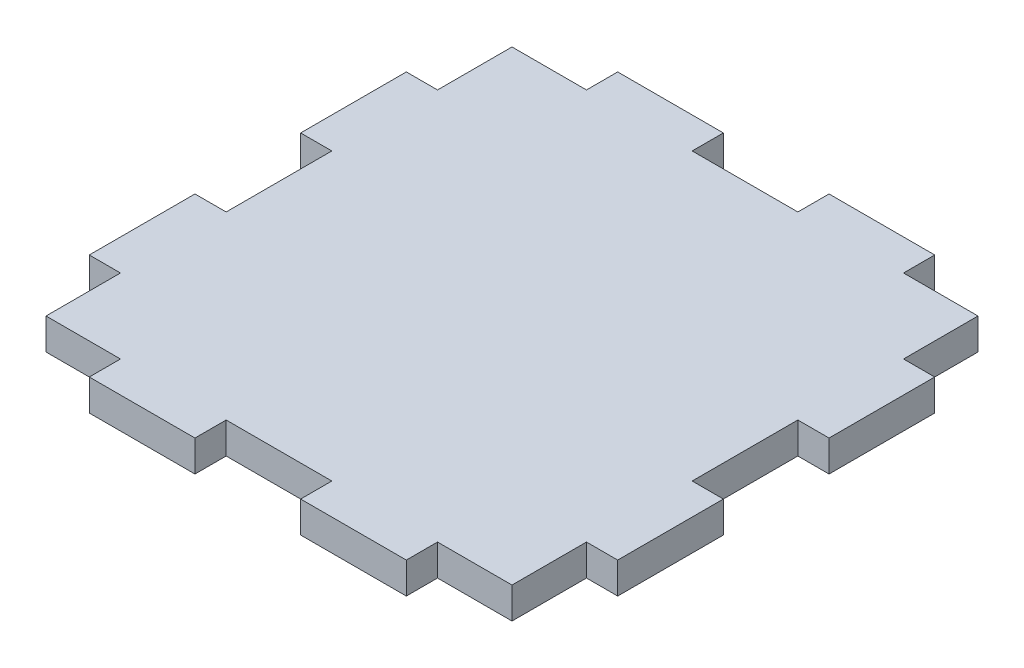
ISO-10303-21;
HEADER;
FILE_DESCRIPTION(('STEP AP214'),'2;1');
FILE_NAME('part.step','',(''),(''),'','','');
FILE_SCHEMA(('AUTOMOTIVE_DESIGN { 1 0 10303 214 1 1 1 1 }'));
ENDSEC;
DATA;
#1=APPLICATION_CONTEXT('core data for automotive mechanical design processes');
#2=APPLICATION_PROTOCOL_DEFINITION('international standard','automotive_design',2000,#1);
#3=PRODUCT_CONTEXT('',#1,'mechanical');
#4=PRODUCT('Part','Part','',(#3));
#5=PRODUCT_RELATED_PRODUCT_CATEGORY('part','',(#4));
#6=PRODUCT_DEFINITION_FORMATION('','',#4);
#7=PRODUCT_DEFINITION_CONTEXT('part definition',#1,'design');
#8=PRODUCT_DEFINITION('design','',#6,#7);
#9=PRODUCT_DEFINITION_SHAPE('','',#8);
#10=(LENGTH_UNIT() NAMED_UNIT(*) SI_UNIT(.MILLI.,.METRE.));
#11=(NAMED_UNIT(*) PLANE_ANGLE_UNIT() SI_UNIT($,.RADIAN.));
#12=(NAMED_UNIT(*) SI_UNIT($,.STERADIAN.) SOLID_ANGLE_UNIT());
#13=UNCERTAINTY_MEASURE_WITH_UNIT(LENGTH_MEASURE(1.E-05),#10,'distance_accuracy_value','');
#14=(GEOMETRIC_REPRESENTATION_CONTEXT(3) GLOBAL_UNCERTAINTY_ASSIGNED_CONTEXT((#13)) GLOBAL_UNIT_ASSIGNED_CONTEXT((#10,
#11,#12)) REPRESENTATION_CONTEXT('',''));
#15=CARTESIAN_POINT('',(0.,0.,0.));
#16=DIRECTION('',(0.,0.,1.));
#17=DIRECTION('',(1.,0.,0.));
#18=AXIS2_PLACEMENT_3D('',#15,#16,#17);
#19=CARTESIAN_POINT('',(0.,3.,0.));
#20=DIRECTION('',(1.,0.,0.));
#21=DIRECTION('',(0.,0.,-1.));
#22=AXIS2_PLACEMENT_3D('',#19,#20,#21);
#23=PLANE('',#22);
#24=DIRECTION('',(0.,1.,0.));
#25=VECTOR('',#24,1.);
#26=CARTESIAN_POINT('',(0.,0.,-30.48));
#27=LINE('',#26,#25);
#28=CARTESIAN_POINT('',(0.,0.,-30.48));
#29=VERTEX_POINT('',#28);
#30=CARTESIAN_POINT('',(0.,3.,-30.48));
#31=VERTEX_POINT('',#30);
#32=EDGE_CURVE('E274',#29,#31,#27,.T.);
#33=ORIENTED_EDGE('',*,*,#32,.T.);
#34=DIRECTION('',(0.,0.,1.));
#35=VECTOR('',#34,1.);
#36=CARTESIAN_POINT('',(0.,3.,0.));
#37=LINE('',#36,#35);
#38=CARTESIAN_POINT('',(0.,3.,-40.64));
#39=VERTEX_POINT('',#38);
#40=EDGE_CURVE('E516',#39,#31,#37,.T.);
#41=ORIENTED_EDGE('',*,*,#40,.F.);
#42=DIRECTION('',(0.,1.,0.));
#43=VECTOR('',#42,1.);
#44=CARTESIAN_POINT('',(0.,0.,-40.64));
#45=LINE('',#44,#43);
#46=CARTESIAN_POINT('',(0.,0.,-40.64));
#47=VERTEX_POINT('',#46);
#48=EDGE_CURVE('E508',#47,#39,#45,.T.);
#49=ORIENTED_EDGE('',*,*,#48,.F.);
#50=DIRECTION('',(0.,0.,1.));
#51=VECTOR('',#50,1.);
#52=CARTESIAN_POINT('',(0.,0.,0.));
#53=LINE('',#52,#51);
#54=EDGE_CURVE('E525',#47,#29,#53,.T.);
#55=ORIENTED_EDGE('',*,*,#54,.T.);
#56=EDGE_LOOP('',(#33,#41,#49,#55));
#57=FACE_BOUND('',#56,.T.);
#58=ADVANCED_FACE('F35',(#57),#23,.F.);
#59=CARTESIAN_POINT('',(0.,3.,0.));
#60=DIRECTION('',(0.,-1.,0.));
#61=DIRECTION('',(0.,0.,-1.));
#62=AXIS2_PLACEMENT_3D('',#59,#60,#61);
#63=PLANE('',#62);
#64=DIRECTION('',(0.,0.,1.));
#65=VECTOR('',#64,1.);
#66=CARTESIAN_POINT('',(2.99999999999988,3.,0.));
#67=LINE('',#66,#65);
#68=CARTESIAN_POINT('',(2.99999999999988,3.,-30.48));
#69=VERTEX_POINT('',#68);
#70=CARTESIAN_POINT('',(2.99999999999988,3.,-20.32));
#71=VERTEX_POINT('',#70);
#72=EDGE_CURVE('E286',#69,#71,#67,.T.);
#73=ORIENTED_EDGE('',*,*,#72,.T.);
#74=DIRECTION('',(1.,0.,0.));
#75=VECTOR('',#74,1.);
#76=CARTESIAN_POINT('',(0.,3.,-20.32));
#77=LINE('',#76,#75);
#78=CARTESIAN_POINT('',(0.,3.,-20.32));
#79=VERTEX_POINT('',#78);
#80=EDGE_CURVE('E291',#79,#71,#77,.T.);
#81=ORIENTED_EDGE('',*,*,#80,.F.);
#82=CARTESIAN_POINT('',(0.,3.,-10.16));
#83=VERTEX_POINT('',#82);
#84=EDGE_CURVE('E60',#79,#83,#37,.T.);
#85=ORIENTED_EDGE('',*,*,#84,.T.);
#86=DIRECTION('',(-1.,0.,0.));
#87=VECTOR('',#86,1.);
#88=CARTESIAN_POINT('',(0.,3.,-10.16));
#89=LINE('',#88,#87);
#90=CARTESIAN_POINT('',(2.99999999999992,3.,-10.16));
#91=VERTEX_POINT('',#90);
#92=EDGE_CURVE('E322',#91,#83,#89,.T.);
#93=ORIENTED_EDGE('',*,*,#92,.F.);
#94=DIRECTION('',(0.,0.,1.));
#95=VECTOR('',#94,1.);
#96=CARTESIAN_POINT('',(3.00000000000004,3.,0.));
#97=LINE('',#96,#95);
#98=CARTESIAN_POINT('',(3.,3.,-3.));
#99=VERTEX_POINT('',#98);
#100=EDGE_CURVE('E319',#91,#99,#97,.T.);
#101=ORIENTED_EDGE('',*,*,#100,.T.);
#102=DIRECTION('',(1.,0.,0.));
#103=VECTOR('',#102,1.);
#104=CARTESIAN_POINT('',(0.,3.,-3.));
#105=LINE('',#104,#103);
#106=CARTESIAN_POINT('',(10.16,3.,-3.));
#107=VERTEX_POINT('',#106);
#108=EDGE_CURVE('E301',#99,#107,#105,.T.);
#109=ORIENTED_EDGE('',*,*,#108,.T.);
#110=DIRECTION('',(0.,0.,-1.));
#111=VECTOR('',#110,1.);
#112=CARTESIAN_POINT('',(10.16,3.,0.));
#113=LINE('',#112,#111);
#114=CARTESIAN_POINT('',(10.16,3.,0.));
#115=VERTEX_POINT('',#114);
#116=EDGE_CURVE('E308',#115,#107,#113,.T.);
#117=ORIENTED_EDGE('',*,*,#116,.F.);
#118=DIRECTION('',(1.,0.,0.));
#119=VECTOR('',#118,1.);
#120=CARTESIAN_POINT('',(0.,3.,0.));
#121=LINE('',#120,#119);
#122=CARTESIAN_POINT('',(20.32,3.,0.));
#123=VERTEX_POINT('',#122);
#124=EDGE_CURVE('E520',#115,#123,#121,.T.);
#125=ORIENTED_EDGE('',*,*,#124,.T.);
#126=DIRECTION('',(0.,0.,-1.));
#127=VECTOR('',#126,1.);
#128=CARTESIAN_POINT('',(20.32,3.,0.));
#129=LINE('',#128,#127);
#130=CARTESIAN_POINT('',(20.32,3.,-3.));
#131=VERTEX_POINT('',#130);
#132=EDGE_CURVE('E328',#123,#131,#129,.T.);
#133=ORIENTED_EDGE('',*,*,#132,.T.);
#134=DIRECTION('',(1.,0.,0.));
#135=VECTOR('',#134,1.);
#136=CARTESIAN_POINT('',(0.,3.,-3.));
#137=LINE('',#136,#135);
#138=CARTESIAN_POINT('',(30.48,3.,-3.));
#139=VERTEX_POINT('',#138);
#140=EDGE_CURVE('E340',#131,#139,#137,.T.);
#141=ORIENTED_EDGE('',*,*,#140,.T.);
#142=DIRECTION('',(0.,0.,-1.));
#143=VECTOR('',#142,1.);
#144=CARTESIAN_POINT('',(30.48,3.,0.));
#145=LINE('',#144,#143);
#146=CARTESIAN_POINT('',(30.48,3.,0.));
#147=VERTEX_POINT('',#146);
#148=EDGE_CURVE('E348',#147,#139,#145,.T.);
#149=ORIENTED_EDGE('',*,*,#148,.F.);
#150=CARTESIAN_POINT('',(40.64,3.,0.));
#151=VERTEX_POINT('',#150);
#152=EDGE_CURVE('E519',#147,#151,#121,.T.);
#153=ORIENTED_EDGE('',*,*,#152,.T.);
#154=DIRECTION('',(0.,0.,-1.));
#155=VECTOR('',#154,1.);
#156=CARTESIAN_POINT('',(40.64,3.,0.));
#157=LINE('',#156,#155);
#158=CARTESIAN_POINT('',(40.64,3.,-3.));
#159=VERTEX_POINT('',#158);
#160=EDGE_CURVE('E366',#151,#159,#157,.T.);
#161=ORIENTED_EDGE('',*,*,#160,.T.);
#162=DIRECTION('',(1.,0.,0.));
#163=VECTOR('',#162,1.);
#164=CARTESIAN_POINT('',(0.,3.,-3.));
#165=LINE('',#164,#163);
#166=CARTESIAN_POINT('',(47.8000000000001,3.,-3.));
#167=VERTEX_POINT('',#166);
#168=EDGE_CURVE('E379',#159,#167,#165,.T.);
#169=ORIENTED_EDGE('',*,*,#168,.T.);
#170=DIRECTION('',(0.,0.,1.));
#171=VECTOR('',#170,1.);
#172=CARTESIAN_POINT('',(47.8000000000003,3.,-9.26478012868066E-13));
#173=LINE('',#172,#171);
#174=CARTESIAN_POINT('',(47.8000000000001,3.,-10.16));
#175=VERTEX_POINT('',#174);
#176=EDGE_CURVE('E376',#175,#167,#173,.T.);
#177=ORIENTED_EDGE('',*,*,#176,.F.);
#178=DIRECTION('',(1.,0.,0.));
#179=VECTOR('',#178,1.);
#180=CARTESIAN_POINT('',(0.,3.,-10.16));
#181=LINE('',#180,#179);
#182=CARTESIAN_POINT('',(50.8,3.,-10.16));
#183=VERTEX_POINT('',#182);
#184=EDGE_CURVE('E356',#175,#183,#181,.T.);
#185=ORIENTED_EDGE('',*,*,#184,.T.);
#186=DIRECTION('',(0.,0.,-1.));
#187=VECTOR('',#186,1.);
#188=CARTESIAN_POINT('',(50.8,3.,0.));
#189=LINE('',#188,#187);
#190=CARTESIAN_POINT('',(50.8,3.,-20.32));
#191=VERTEX_POINT('',#190);
#192=EDGE_CURVE('E523',#183,#191,#189,.T.);
#193=ORIENTED_EDGE('',*,*,#192,.T.);
#194=DIRECTION('',(-1.,0.,0.));
#195=VECTOR('',#194,1.);
#196=CARTESIAN_POINT('',(0.,3.,-20.32));
#197=LINE('',#196,#195);
#198=CARTESIAN_POINT('',(47.8000000000001,3.,-20.32));
#199=VERTEX_POINT('',#198);
#200=EDGE_CURVE('E399',#191,#199,#197,.T.);
#201=ORIENTED_EDGE('',*,*,#200,.T.);
#202=DIRECTION('',(0.,0.,1.));
#203=VECTOR('',#202,1.);
#204=CARTESIAN_POINT('',(47.8000000000001,3.,0.));
#205=LINE('',#204,#203);
#206=CARTESIAN_POINT('',(47.8000000000001,3.,-30.48));
#207=VERTEX_POINT('',#206);
#208=EDGE_CURVE('E408',#207,#199,#205,.T.);
#209=ORIENTED_EDGE('',*,*,#208,.F.);
#210=DIRECTION('',(-1.,0.,0.));
#211=VECTOR('',#210,1.);
#212=CARTESIAN_POINT('',(0.,3.,-30.4799999999999));
#213=LINE('',#212,#211);
#214=CARTESIAN_POINT('',(50.8,3.,-30.48));
#215=VERTEX_POINT('',#214);
#216=EDGE_CURVE('E386',#215,#207,#213,.T.);
#217=ORIENTED_EDGE('',*,*,#216,.F.);
#218=CARTESIAN_POINT('',(50.8,3.,-40.64));
#219=VERTEX_POINT('',#218);
#220=EDGE_CURVE('E522',#215,#219,#189,.T.);
#221=ORIENTED_EDGE('',*,*,#220,.T.);
#222=DIRECTION('',(-1.,0.,0.));
#223=VECTOR('',#222,1.);
#224=CARTESIAN_POINT('',(0.,3.,-40.64));
#225=LINE('',#224,#223);
#226=CARTESIAN_POINT('',(47.8000000000001,3.,-40.64));
#227=VERTEX_POINT('',#226);
#228=EDGE_CURVE('E426',#219,#227,#225,.T.);
#229=ORIENTED_EDGE('',*,*,#228,.T.);
#230=DIRECTION('',(0.,0.,1.));
#231=VECTOR('',#230,1.);
#232=CARTESIAN_POINT('',(47.7999999999993,3.,9.26478012868046E-13));
#233=LINE('',#232,#231);
#234=CARTESIAN_POINT('',(47.8000000000002,3.,-47.8));
#235=VERTEX_POINT('',#234);
#236=EDGE_CURVE('E440',#235,#227,#233,.T.);
#237=ORIENTED_EDGE('',*,*,#236,.F.);
#238=DIRECTION('',(1.,0.,0.));
#239=VECTOR('',#238,1.);
#240=CARTESIAN_POINT('',(0.,3.,-47.8));
#241=LINE('',#240,#239);
#242=CARTESIAN_POINT('',(40.64,3.,-47.8));
#243=VERTEX_POINT('',#242);
#244=EDGE_CURVE('E437',#243,#235,#241,.T.);
#245=ORIENTED_EDGE('',*,*,#244,.F.);
#246=DIRECTION('',(0.,0.,1.));
#247=VECTOR('',#246,1.);
#248=CARTESIAN_POINT('',(40.64,3.,0.));
#249=LINE('',#248,#247);
#250=CARTESIAN_POINT('',(40.64,3.,-50.8));
#251=VERTEX_POINT('',#250);
#252=EDGE_CURVE('E415',#251,#243,#249,.T.);
#253=ORIENTED_EDGE('',*,*,#252,.F.);
#254=DIRECTION('',(-1.,0.,0.));
#255=VECTOR('',#254,1.);
#256=CARTESIAN_POINT('',(0.,3.,-50.8));
#257=LINE('',#256,#255);
#258=CARTESIAN_POINT('',(30.48,3.,-50.8));
#259=VERTEX_POINT('',#258);
#260=EDGE_CURVE('E11',#251,#259,#257,.T.);
#261=ORIENTED_EDGE('',*,*,#260,.T.);
#262=DIRECTION('',(0.,0.,1.));
#263=VECTOR('',#262,1.);
#264=CARTESIAN_POINT('',(30.4800000000004,3.,-2.81996648254794E-13));
#265=LINE('',#264,#263);
#266=CARTESIAN_POINT('',(30.48,3.,-47.8));
#267=VERTEX_POINT('',#266);
#268=EDGE_CURVE('E447',#259,#267,#265,.T.);
#269=ORIENTED_EDGE('',*,*,#268,.T.);
#270=DIRECTION('',(1.,0.,0.));
#271=VECTOR('',#270,1.);
#272=CARTESIAN_POINT('',(0.,3.,-47.8));
#273=LINE('',#272,#271);
#274=CARTESIAN_POINT('',(20.32,3.,-47.8));
#275=VERTEX_POINT('',#274);
#276=EDGE_CURVE('E459',#275,#267,#273,.T.);
#277=ORIENTED_EDGE('',*,*,#276,.F.);
#278=DIRECTION('',(0.,0.,1.));
#279=VECTOR('',#278,1.);
#280=CARTESIAN_POINT('',(20.3199999999999,3.,0.));
#281=LINE('',#280,#279);
#282=CARTESIAN_POINT('',(20.32,3.,-50.8));
#283=VERTEX_POINT('',#282);
#284=EDGE_CURVE('E468',#283,#275,#281,.T.);
#285=ORIENTED_EDGE('',*,*,#284,.F.);
#286=CARTESIAN_POINT('',(10.16,3.,-50.8));
#287=VERTEX_POINT('',#286);
#288=EDGE_CURVE('E44',#283,#287,#257,.T.);
#289=ORIENTED_EDGE('',*,*,#288,.T.);
#290=DIRECTION('',(0.,0.,1.));
#291=VECTOR('',#290,1.);
#292=CARTESIAN_POINT('',(10.16,3.,0.));
#293=LINE('',#292,#291);
#294=CARTESIAN_POINT('',(10.16,3.,-47.8));
#295=VERTEX_POINT('',#294);
#296=EDGE_CURVE('E500',#287,#295,#293,.T.);
#297=ORIENTED_EDGE('',*,*,#296,.T.);
#298=DIRECTION('',(1.,0.,0.));
#299=VECTOR('',#298,1.);
#300=CARTESIAN_POINT('',(0.,3.,-47.8));
#301=LINE('',#300,#299);
#302=CARTESIAN_POINT('',(2.99999999999985,3.,-47.8));
#303=VERTEX_POINT('',#302);
#304=EDGE_CURVE('E497',#303,#295,#301,.T.);
#305=ORIENTED_EDGE('',*,*,#304,.F.);
#306=DIRECTION('',(0.,0.,1.));
#307=VECTOR('',#306,1.);
#308=CARTESIAN_POINT('',(3.00000000000071,3.,0.));
#309=LINE('',#308,#307);
#310=CARTESIAN_POINT('',(2.99999999999992,3.,-40.64));
#311=VERTEX_POINT('',#310);
#312=EDGE_CURVE('E475',#303,#311,#309,.T.);
#313=ORIENTED_EDGE('',*,*,#312,.T.);
#314=DIRECTION('',(1.,0.,0.));
#315=VECTOR('',#314,1.);
#316=CARTESIAN_POINT('',(0.,3.,-40.64));
#317=LINE('',#316,#315);
#318=EDGE_CURVE('E485',#39,#311,#317,.T.);
#319=ORIENTED_EDGE('',*,*,#318,.F.);
#320=ORIENTED_EDGE('',*,*,#40,.T.);
#321=DIRECTION('',(1.,0.,0.));
#322=VECTOR('',#321,1.);
#323=CARTESIAN_POINT('',(0.,3.,-30.48));
#324=LINE('',#323,#322);
#325=EDGE_CURVE('E52',#31,#69,#324,.T.);
#326=ORIENTED_EDGE('',*,*,#325,.T.);
#327=EDGE_LOOP('',(#73,#81,#85,#93,#101,#109,#117,#125,#133,#141,#149,#153,#161,#169,#177,#185,
#193,#201,#209,#217,#221,#229,#237,#245,#253,#261,#269,#277,#285,#289,#297,#305,#313,#319,#320,#326));
#328=FACE_BOUND('',#327,.T.);
#329=ADVANCED_FACE('F553',(#328),#63,.F.);
#330=CARTESIAN_POINT('',(0.,0.,0.));
#331=DIRECTION('',(0.,-1.,0.));
#332=DIRECTION('',(0.,0.,-1.));
#333=AXIS2_PLACEMENT_3D('',#330,#331,#332);
#334=PLANE('',#333);
#335=DIRECTION('',(1.,0.,0.));
#336=VECTOR('',#335,1.);
#337=CARTESIAN_POINT('',(0.,0.,-20.32));
#338=LINE('',#337,#336);
#339=CARTESIAN_POINT('',(0.,0.,-20.32));
#340=VERTEX_POINT('',#339);
#341=CARTESIAN_POINT('',(2.99999999999988,0.,-20.32));
#342=VERTEX_POINT('',#341);
#343=EDGE_CURVE('E279',#340,#342,#338,.T.);
#344=ORIENTED_EDGE('',*,*,#343,.T.);
#345=DIRECTION('',(0.,0.,1.));
#346=VECTOR('',#345,1.);
#347=CARTESIAN_POINT('',(2.99999999999988,0.,0.));
#348=LINE('',#347,#346);
#349=CARTESIAN_POINT('',(2.99999999999988,0.,-30.48));
#350=VERTEX_POINT('',#349);
#351=EDGE_CURVE('E280',#350,#342,#348,.T.);
#352=ORIENTED_EDGE('',*,*,#351,.F.);
#353=DIRECTION('',(1.,0.,0.));
#354=VECTOR('',#353,1.);
#355=CARTESIAN_POINT('',(0.,0.,-30.48));
#356=LINE('',#355,#354);
#357=EDGE_CURVE('E269',#29,#350,#356,.T.);
#358=ORIENTED_EDGE('',*,*,#357,.F.);
#359=ORIENTED_EDGE('',*,*,#54,.F.);
#360=DIRECTION('',(1.,0.,0.));
#361=VECTOR('',#360,1.);
#362=CARTESIAN_POINT('',(0.,0.,-40.64));
#363=LINE('',#362,#361);
#364=CARTESIAN_POINT('',(2.99999999999992,0.,-40.64));
#365=VERTEX_POINT('',#364);
#366=EDGE_CURVE('E491',#47,#365,#363,.T.);
#367=ORIENTED_EDGE('',*,*,#366,.T.);
#368=DIRECTION('',(0.,0.,1.));
#369=VECTOR('',#368,1.);
#370=CARTESIAN_POINT('',(3.00000000000071,0.,0.));
#371=LINE('',#370,#369);
#372=CARTESIAN_POINT('',(2.99999999999985,0.,-47.8));
#373=VERTEX_POINT('',#372);
#374=EDGE_CURVE('E482',#373,#365,#371,.T.);
#375=ORIENTED_EDGE('',*,*,#374,.F.);
#376=DIRECTION('',(1.,0.,0.));
#377=VECTOR('',#376,1.);
#378=CARTESIAN_POINT('',(0.,0.,-47.8));
#379=LINE('',#378,#377);
#380=CARTESIAN_POINT('',(10.16,0.,-47.8));
#381=VERTEX_POINT('',#380);
#382=EDGE_CURVE('E484',#373,#381,#379,.T.);
#383=ORIENTED_EDGE('',*,*,#382,.T.);
#384=DIRECTION('',(0.,0.,1.));
#385=VECTOR('',#384,1.);
#386=CARTESIAN_POINT('',(10.16,0.,0.));
#387=LINE('',#386,#385);
#388=CARTESIAN_POINT('',(10.16,0.,-50.8));
#389=VERTEX_POINT('',#388);
#390=EDGE_CURVE('E488',#389,#381,#387,.T.);
#391=ORIENTED_EDGE('',*,*,#390,.F.);
#392=DIRECTION('',(-1.,0.,0.));
#393=VECTOR('',#392,1.);
#394=CARTESIAN_POINT('',(0.,0.,-50.8));
#395=LINE('',#394,#393);
#396=CARTESIAN_POINT('',(20.32,0.,-50.8));
#397=VERTEX_POINT('',#396);
#398=EDGE_CURVE('E531',#397,#389,#395,.T.);
#399=ORIENTED_EDGE('',*,*,#398,.F.);
#400=DIRECTION('',(0.,0.,1.));
#401=VECTOR('',#400,1.);
#402=CARTESIAN_POINT('',(20.3199999999999,0.,0.));
#403=LINE('',#402,#401);
#404=CARTESIAN_POINT('',(20.32,0.,-47.8));
#405=VERTEX_POINT('',#404);
#406=EDGE_CURVE('E458',#397,#405,#403,.T.);
#407=ORIENTED_EDGE('',*,*,#406,.T.);
#408=DIRECTION('',(1.,0.,0.));
#409=VECTOR('',#408,1.);
#410=CARTESIAN_POINT('',(0.,0.,-47.8));
#411=LINE('',#410,#409);
#412=CARTESIAN_POINT('',(30.48,0.,-47.8));
#413=VERTEX_POINT('',#412);
#414=EDGE_CURVE('E462',#405,#413,#411,.T.);
#415=ORIENTED_EDGE('',*,*,#414,.T.);
#416=DIRECTION('',(0.,0.,1.));
#417=VECTOR('',#416,1.);
#418=CARTESIAN_POINT('',(30.4800000000004,0.,-2.81996648254794E-13));
#419=LINE('',#418,#417);
#420=CARTESIAN_POINT('',(30.48,0.,-50.8));
#421=VERTEX_POINT('',#420);
#422=EDGE_CURVE('E456',#421,#413,#419,.T.);
#423=ORIENTED_EDGE('',*,*,#422,.F.);
#424=CARTESIAN_POINT('',(40.64,0.,-50.8));
#425=VERTEX_POINT('',#424);
#426=EDGE_CURVE('E39',#425,#421,#395,.T.);
#427=ORIENTED_EDGE('',*,*,#426,.F.);
#428=DIRECTION('',(0.,0.,1.));
#429=VECTOR('',#428,1.);
#430=CARTESIAN_POINT('',(40.64,0.,0.));
#431=LINE('',#430,#429);
#432=CARTESIAN_POINT('',(40.64,0.,-47.8));
#433=VERTEX_POINT('',#432);
#434=EDGE_CURVE('E422',#425,#433,#431,.T.);
#435=ORIENTED_EDGE('',*,*,#434,.T.);
#436=DIRECTION('',(1.,0.,0.));
#437=VECTOR('',#436,1.);
#438=CARTESIAN_POINT('',(0.,0.,-47.8));
#439=LINE('',#438,#437);
#440=CARTESIAN_POINT('',(47.8000000000002,0.,-47.8));
#441=VERTEX_POINT('',#440);
#442=EDGE_CURVE('E425',#433,#441,#439,.T.);
#443=ORIENTED_EDGE('',*,*,#442,.T.);
#444=DIRECTION('',(0.,0.,1.));
#445=VECTOR('',#444,1.);
#446=CARTESIAN_POINT('',(47.7999999999993,0.,9.26478012868046E-13));
#447=LINE('',#446,#445);
#448=CARTESIAN_POINT('',(47.8000000000001,0.,-40.64));
#449=VERTEX_POINT('',#448);
#450=EDGE_CURVE('E429',#441,#449,#447,.T.);
#451=ORIENTED_EDGE('',*,*,#450,.T.);
#452=DIRECTION('',(-1.,0.,0.));
#453=VECTOR('',#452,1.);
#454=CARTESIAN_POINT('',(0.,0.,-40.64));
#455=LINE('',#454,#453);
#456=CARTESIAN_POINT('',(50.8,0.,-40.64));
#457=VERTEX_POINT('',#456);
#458=EDGE_CURVE('E432',#457,#449,#455,.T.);
#459=ORIENTED_EDGE('',*,*,#458,.F.);
#460=DIRECTION('',(0.,0.,-1.));
#461=VECTOR('',#460,1.);
#462=CARTESIAN_POINT('',(50.8,0.,0.));
#463=LINE('',#462,#461);
#464=CARTESIAN_POINT('',(50.8,0.,-30.48));
#465=VERTEX_POINT('',#464);
#466=EDGE_CURVE('E529',#465,#457,#463,.T.);
#467=ORIENTED_EDGE('',*,*,#466,.F.);
#468=DIRECTION('',(-1.,0.,0.));
#469=VECTOR('',#468,1.);
#470=CARTESIAN_POINT('',(0.,0.,-30.4799999999999));
#471=LINE('',#470,#469);
#472=CARTESIAN_POINT('',(47.8000000000001,0.,-30.48));
#473=VERTEX_POINT('',#472);
#474=EDGE_CURVE('E395',#465,#473,#471,.T.);
#475=ORIENTED_EDGE('',*,*,#474,.T.);
#476=DIRECTION('',(0.,0.,1.));
#477=VECTOR('',#476,1.);
#478=CARTESIAN_POINT('',(47.8000000000001,0.,0.));
#479=LINE('',#478,#477);
#480=CARTESIAN_POINT('',(47.8000000000001,0.,-20.32));
#481=VERTEX_POINT('',#480);
#482=EDGE_CURVE('E398',#473,#481,#479,.T.);
#483=ORIENTED_EDGE('',*,*,#482,.T.);
#484=DIRECTION('',(-1.,0.,0.));
#485=VECTOR('',#484,1.);
#486=CARTESIAN_POINT('',(0.,0.,-20.32));
#487=LINE('',#486,#485);
#488=CARTESIAN_POINT('',(50.8,0.,-20.32));
#489=VERTEX_POINT('',#488);
#490=EDGE_CURVE('E402',#489,#481,#487,.T.);
#491=ORIENTED_EDGE('',*,*,#490,.F.);
#492=CARTESIAN_POINT('',(50.8,0.,-10.16));
#493=VERTEX_POINT('',#492);
#494=EDGE_CURVE('E530',#493,#489,#463,.T.);
#495=ORIENTED_EDGE('',*,*,#494,.F.);
#496=DIRECTION('',(1.,0.,0.));
#497=VECTOR('',#496,1.);
#498=CARTESIAN_POINT('',(0.,0.,-10.16));
#499=LINE('',#498,#497);
#500=CARTESIAN_POINT('',(47.8000000000001,0.,-10.16));
#501=VERTEX_POINT('',#500);
#502=EDGE_CURVE('E363',#501,#493,#499,.T.);
#503=ORIENTED_EDGE('',*,*,#502,.F.);
#504=DIRECTION('',(0.,0.,1.));
#505=VECTOR('',#504,1.);
#506=CARTESIAN_POINT('',(47.8000000000003,0.,-9.26478012868066E-13));
#507=LINE('',#506,#505);
#508=CARTESIAN_POINT('',(47.8000000000001,0.,-3.));
#509=VERTEX_POINT('',#508);
#510=EDGE_CURVE('E365',#501,#509,#507,.T.);
#511=ORIENTED_EDGE('',*,*,#510,.T.);
#512=DIRECTION('',(1.,0.,0.));
#513=VECTOR('',#512,1.);
#514=CARTESIAN_POINT('',(0.,0.,-3.));
#515=LINE('',#514,#513);
#516=CARTESIAN_POINT('',(40.64,0.,-3.));
#517=VERTEX_POINT('',#516);
#518=EDGE_CURVE('E369',#517,#509,#515,.T.);
#519=ORIENTED_EDGE('',*,*,#518,.F.);
#520=DIRECTION('',(0.,0.,-1.));
#521=VECTOR('',#520,1.);
#522=CARTESIAN_POINT('',(40.64,0.,0.));
#523=LINE('',#522,#521);
#524=CARTESIAN_POINT('',(40.64,0.,0.));
#525=VERTEX_POINT('',#524);
#526=EDGE_CURVE('E371',#525,#517,#523,.T.);
#527=ORIENTED_EDGE('',*,*,#526,.F.);
#528=DIRECTION('',(1.,0.,0.));
#529=VECTOR('',#528,1.);
#530=CARTESIAN_POINT('',(0.,0.,0.));
#531=LINE('',#530,#529);
#532=CARTESIAN_POINT('',(30.48,0.,0.));
#533=VERTEX_POINT('',#532);
#534=EDGE_CURVE('E527',#533,#525,#531,.T.);
#535=ORIENTED_EDGE('',*,*,#534,.F.);
#536=DIRECTION('',(0.,0.,-1.));
#537=VECTOR('',#536,1.);
#538=CARTESIAN_POINT('',(30.48,0.,0.));
#539=LINE('',#538,#537);
#540=CARTESIAN_POINT('',(30.48,0.,-3.));
#541=VERTEX_POINT('',#540);
#542=EDGE_CURVE('E339',#533,#541,#539,.T.);
#543=ORIENTED_EDGE('',*,*,#542,.T.);
#544=DIRECTION('',(1.,0.,0.));
#545=VECTOR('',#544,1.);
#546=CARTESIAN_POINT('',(0.,0.,-3.));
#547=LINE('',#546,#545);
#548=CARTESIAN_POINT('',(20.32,0.,-3.));
#549=VERTEX_POINT('',#548);
#550=EDGE_CURVE('E343',#549,#541,#547,.T.);
#551=ORIENTED_EDGE('',*,*,#550,.F.);
#552=DIRECTION('',(0.,0.,-1.));
#553=VECTOR('',#552,1.);
#554=CARTESIAN_POINT('',(20.32,0.,0.));
#555=LINE('',#554,#553);
#556=CARTESIAN_POINT('',(20.32,0.,0.));
#557=VERTEX_POINT('',#556);
#558=EDGE_CURVE('E337',#557,#549,#555,.T.);
#559=ORIENTED_EDGE('',*,*,#558,.F.);
#560=CARTESIAN_POINT('',(10.16,0.,0.));
#561=VERTEX_POINT('',#560);
#562=EDGE_CURVE('E528',#561,#557,#531,.T.);
#563=ORIENTED_EDGE('',*,*,#562,.F.);
#564=DIRECTION('',(0.,0.,-1.));
#565=VECTOR('',#564,1.);
#566=CARTESIAN_POINT('',(10.16,0.,0.));
#567=LINE('',#566,#565);
#568=CARTESIAN_POINT('',(10.16,0.,-3.));
#569=VERTEX_POINT('',#568);
#570=EDGE_CURVE('E313',#561,#569,#567,.T.);
#571=ORIENTED_EDGE('',*,*,#570,.T.);
#572=DIRECTION('',(1.,0.,0.));
#573=VECTOR('',#572,1.);
#574=CARTESIAN_POINT('',(0.,0.,-3.));
#575=LINE('',#574,#573);
#576=CARTESIAN_POINT('',(3.,0.,-3.));
#577=VERTEX_POINT('',#576);
#578=EDGE_CURVE('E305',#577,#569,#575,.T.);
#579=ORIENTED_EDGE('',*,*,#578,.F.);
#580=DIRECTION('',(0.,0.,1.));
#581=VECTOR('',#580,1.);
#582=CARTESIAN_POINT('',(3.00000000000004,0.,0.));
#583=LINE('',#582,#581);
#584=CARTESIAN_POINT('',(2.99999999999992,0.,-10.16));
#585=VERTEX_POINT('',#584);
#586=EDGE_CURVE('E307',#585,#577,#583,.T.);
#587=ORIENTED_EDGE('',*,*,#586,.F.);
#588=DIRECTION('',(-1.,0.,0.));
#589=VECTOR('',#588,1.);
#590=CARTESIAN_POINT('',(0.,0.,-10.16));
#591=LINE('',#590,#589);
#592=CARTESIAN_POINT('',(0.,0.,-10.16));
#593=VERTEX_POINT('',#592);
#594=EDGE_CURVE('E310',#585,#593,#591,.T.);
#595=ORIENTED_EDGE('',*,*,#594,.T.);
#596=EDGE_CURVE('E507',#340,#593,#53,.T.);
#597=ORIENTED_EDGE('',*,*,#596,.F.);
#598=EDGE_LOOP('',(#344,#352,#358,#359,#367,#375,#383,#391,#399,#407,#415,#423,#427,#435,#443,
#451,#459,#467,#475,#483,#491,#495,#503,#511,#519,#527,#535,#543,#551,#559,#563,#571,#579,#587,
#595,#597));
#599=FACE_BOUND('',#598,.T.);
#600=ADVANCED_FACE('F289',(#599),#334,.T.);
#601=CARTESIAN_POINT('',(0.,3.,0.));
#602=DIRECTION('',(0.,0.,-1.));
#603=DIRECTION('',(-1.,0.,0.));
#604=AXIS2_PLACEMENT_3D('',#601,#602,#603);
#605=PLANE('',#604);
#606=ORIENTED_EDGE('',*,*,#124,.F.);
#607=DIRECTION('',(0.,1.,0.));
#608=VECTOR('',#607,1.);
#609=CARTESIAN_POINT('',(10.16,0.,0.));
#610=LINE('',#609,#608);
#611=EDGE_CURVE('E329',#561,#115,#610,.T.);
#612=ORIENTED_EDGE('',*,*,#611,.F.);
#613=ORIENTED_EDGE('',*,*,#562,.T.);
#614=DIRECTION('',(0.,1.,0.));
#615=VECTOR('',#614,1.);
#616=CARTESIAN_POINT('',(20.32,0.,0.));
#617=LINE('',#616,#615);
#618=EDGE_CURVE('E345',#557,#123,#617,.T.);
#619=ORIENTED_EDGE('',*,*,#618,.T.);
#620=EDGE_LOOP('',(#606,#612,#613,#619));
#621=FACE_BOUND('',#620,.T.);
#622=ADVANCED_FACE('F609',(#621),#605,.F.);
#623=CARTESIAN_POINT('',(50.8,3.,0.));
#624=DIRECTION('',(-1.,0.,0.));
#625=DIRECTION('',(0.,0.,1.));
#626=AXIS2_PLACEMENT_3D('',#623,#624,#625);
#627=PLANE('',#626);
#628=DIRECTION('',(0.,1.,0.));
#629=VECTOR('',#628,1.);
#630=CARTESIAN_POINT('',(50.8,0.,-10.16));
#631=LINE('',#630,#629);
#632=EDGE_CURVE('E384',#493,#183,#631,.T.);
#633=ORIENTED_EDGE('',*,*,#632,.F.);
#634=ORIENTED_EDGE('',*,*,#494,.T.);
#635=DIRECTION('',(0.,1.,0.));
#636=VECTOR('',#635,1.);
#637=CARTESIAN_POINT('',(50.8,0.,-20.32));
#638=LINE('',#637,#636);
#639=EDGE_CURVE('E416',#489,#191,#638,.T.);
#640=ORIENTED_EDGE('',*,*,#639,.T.);
#641=ORIENTED_EDGE('',*,*,#192,.F.);
#642=EDGE_LOOP('',(#633,#634,#640,#641));
#643=FACE_BOUND('',#642,.T.);
#644=ADVANCED_FACE('F566',(#643),#627,.F.);
#645=ORIENTED_EDGE('',*,*,#152,.F.);
#646=DIRECTION('',(0.,1.,0.));
#647=VECTOR('',#646,1.);
#648=CARTESIAN_POINT('',(30.48,0.,0.));
#649=LINE('',#648,#647);
#650=EDGE_CURVE('E359',#533,#147,#649,.T.);
#651=ORIENTED_EDGE('',*,*,#650,.F.);
#652=ORIENTED_EDGE('',*,*,#534,.T.);
#653=DIRECTION('',(0.,1.,0.));
#654=VECTOR('',#653,1.);
#655=CARTESIAN_POINT('',(40.64,0.,0.));
#656=LINE('',#655,#654);
#657=EDGE_CURVE('E387',#525,#151,#656,.T.);
#658=ORIENTED_EDGE('',*,*,#657,.T.);
#659=EDGE_LOOP('',(#645,#651,#652,#658));
#660=FACE_BOUND('',#659,.T.);
#661=ADVANCED_FACE('F591',(#660),#605,.F.);
#662=ORIENTED_EDGE('',*,*,#220,.F.);
#663=DIRECTION('',(0.,1.,0.));
#664=VECTOR('',#663,1.);
#665=CARTESIAN_POINT('',(50.8,0.,-30.48));
#666=LINE('',#665,#664);
#667=EDGE_CURVE('E413',#465,#215,#666,.T.);
#668=ORIENTED_EDGE('',*,*,#667,.F.);
#669=ORIENTED_EDGE('',*,*,#466,.T.);
#670=DIRECTION('',(0.,1.,0.));
#671=VECTOR('',#670,1.);
#672=CARTESIAN_POINT('',(50.8,0.,-40.64));
#673=LINE('',#672,#671);
#674=EDGE_CURVE('E448',#457,#219,#673,.T.);
#675=ORIENTED_EDGE('',*,*,#674,.T.);
#676=EDGE_LOOP('',(#662,#668,#669,#675));
#677=FACE_BOUND('',#676,.T.);
#678=ADVANCED_FACE('F541',(#677),#627,.F.);
#679=CARTESIAN_POINT('',(0.,3.,-50.8));
#680=DIRECTION('',(0.,0.,1.));
#681=DIRECTION('',(1.,0.,0.));
#682=AXIS2_PLACEMENT_3D('',#679,#680,#681);
#683=PLANE('',#682);
#684=ORIENTED_EDGE('',*,*,#260,.F.);
#685=DIRECTION('',(0.,1.,0.));
#686=VECTOR('',#685,1.);
#687=CARTESIAN_POINT('',(40.64,0.,-50.8));
#688=LINE('',#687,#686);
#689=EDGE_CURVE('E445',#425,#251,#688,.T.);
#690=ORIENTED_EDGE('',*,*,#689,.F.);
#691=ORIENTED_EDGE('',*,*,#426,.T.);
#692=DIRECTION('',(0.,1.,0.));
#693=VECTOR('',#692,1.);
#694=CARTESIAN_POINT('',(30.48,0.,-50.8));
#695=LINE('',#694,#693);
#696=EDGE_CURVE('E465',#421,#259,#695,.T.);
#697=ORIENTED_EDGE('',*,*,#696,.T.);
#698=EDGE_LOOP('',(#684,#690,#691,#697));
#699=FACE_BOUND('',#698,.T.);
#700=ADVANCED_FACE('F671',(#699),#683,.F.);
#701=ORIENTED_EDGE('',*,*,#288,.F.);
#702=DIRECTION('',(0.,1.,0.));
#703=VECTOR('',#702,1.);
#704=CARTESIAN_POINT('',(20.32,0.,-50.8));
#705=LINE('',#704,#703);
#706=EDGE_CURVE('E478',#397,#283,#705,.T.);
#707=ORIENTED_EDGE('',*,*,#706,.F.);
#708=ORIENTED_EDGE('',*,*,#398,.T.);
#709=DIRECTION('',(0.,1.,0.));
#710=VECTOR('',#709,1.);
#711=CARTESIAN_POINT('',(10.16,0.,-50.8));
#712=LINE('',#711,#710);
#713=EDGE_CURVE('E510',#389,#287,#712,.T.);
#714=ORIENTED_EDGE('',*,*,#713,.T.);
#715=EDGE_LOOP('',(#701,#707,#708,#714));
#716=FACE_BOUND('',#715,.T.);
#717=ADVANCED_FACE('F653',(#716),#683,.F.);
#718=ORIENTED_EDGE('',*,*,#84,.F.);
#719=DIRECTION('',(0.,1.,0.));
#720=VECTOR('',#719,1.);
#721=CARTESIAN_POINT('',(0.,0.,-20.32));
#722=LINE('',#721,#720);
#723=EDGE_CURVE('E302',#340,#79,#722,.T.);
#724=ORIENTED_EDGE('',*,*,#723,.F.);
#725=ORIENTED_EDGE('',*,*,#596,.T.);
#726=DIRECTION('',(0.,1.,0.));
#727=VECTOR('',#726,1.);
#728=CARTESIAN_POINT('',(0.,0.,-10.16));
#729=LINE('',#728,#727);
#730=EDGE_CURVE('E331',#593,#83,#729,.T.);
#731=ORIENTED_EDGE('',*,*,#730,.T.);
#732=EDGE_LOOP('',(#718,#724,#725,#731));
#733=FACE_BOUND('',#732,.T.);
#734=ADVANCED_FACE('F37',(#733),#23,.F.);
#735=CARTESIAN_POINT('',(3.00000000000071,0.,0.));
#736=DIRECTION('',(-1.,0.,0.));
#737=DIRECTION('',(0.,0.,1.));
#738=AXIS2_PLACEMENT_3D('',#735,#736,#737);
#739=PLANE('',#738);
#740=ORIENTED_EDGE('',*,*,#312,.F.);
#741=DIRECTION('',(0.,1.,0.));
#742=VECTOR('',#741,1.);
#743=CARTESIAN_POINT('',(2.99999999999985,0.,-47.8));
#744=LINE('',#743,#742);
#745=EDGE_CURVE('E494',#373,#303,#744,.T.);
#746=ORIENTED_EDGE('',*,*,#745,.F.);
#747=ORIENTED_EDGE('',*,*,#374,.T.);
#748=DIRECTION('',(0.,1.,0.));
#749=VECTOR('',#748,1.);
#750=CARTESIAN_POINT('',(2.99999999999992,0.,-40.64));
#751=LINE('',#750,#749);
#752=EDGE_CURVE('E505',#365,#311,#751,.T.);
#753=ORIENTED_EDGE('',*,*,#752,.T.);
#754=EDGE_LOOP('',(#740,#746,#747,#753));
#755=FACE_BOUND('',#754,.T.);
#756=ADVANCED_FACE('F640',(#755),#739,.T.);
#757=CARTESIAN_POINT('',(0.,0.,-40.64));
#758=DIRECTION('',(0.,0.,1.));
#759=DIRECTION('',(1.,0.,0.));
#760=AXIS2_PLACEMENT_3D('',#757,#758,#759);
#761=PLANE('',#760);
#762=ORIENTED_EDGE('',*,*,#318,.T.);
#763=ORIENTED_EDGE('',*,*,#752,.F.);
#764=ORIENTED_EDGE('',*,*,#366,.F.);
#765=ORIENTED_EDGE('',*,*,#48,.T.);
#766=EDGE_LOOP('',(#762,#763,#764,#765));
#767=FACE_BOUND('',#766,.T.);
#768=ADVANCED_FACE('F637',(#767),#761,.F.);
#769=CARTESIAN_POINT('',(10.16,0.,0.));
#770=DIRECTION('',(-1.,0.,0.));
#771=DIRECTION('',(0.,0.,1.));
#772=AXIS2_PLACEMENT_3D('',#769,#770,#771);
#773=PLANE('',#772);
#774=ORIENTED_EDGE('',*,*,#296,.F.);
#775=ORIENTED_EDGE('',*,*,#713,.F.);
#776=ORIENTED_EDGE('',*,*,#390,.T.);
#777=DIRECTION('',(0.,1.,0.));
#778=VECTOR('',#777,1.);
#779=CARTESIAN_POINT('',(10.16,0.,-47.8));
#780=LINE('',#779,#778);
#781=EDGE_CURVE('E513',#381,#295,#780,.T.);
#782=ORIENTED_EDGE('',*,*,#781,.T.);
#783=EDGE_LOOP('',(#774,#775,#776,#782));
#784=FACE_BOUND('',#783,.T.);
#785=ADVANCED_FACE('F650',(#784),#773,.T.);
#786=CARTESIAN_POINT('',(0.,0.,-47.8));
#787=DIRECTION('',(0.,0.,1.));
#788=DIRECTION('',(1.,0.,0.));
#789=AXIS2_PLACEMENT_3D('',#786,#787,#788);
#790=PLANE('',#789);
#791=ORIENTED_EDGE('',*,*,#304,.T.);
#792=ORIENTED_EDGE('',*,*,#781,.F.);
#793=ORIENTED_EDGE('',*,*,#382,.F.);
#794=ORIENTED_EDGE('',*,*,#745,.T.);
#795=EDGE_LOOP('',(#791,#792,#793,#794));
#796=FACE_BOUND('',#795,.T.);
#797=ADVANCED_FACE('F644',(#796),#790,.F.);
#798=CARTESIAN_POINT('',(30.4800000000004,0.,-2.81996648254794E-13));
#799=DIRECTION('',(-1.,0.,0.));
#800=DIRECTION('',(0.,0.,1.));
#801=AXIS2_PLACEMENT_3D('',#798,#799,#800);
#802=PLANE('',#801);
#803=ORIENTED_EDGE('',*,*,#268,.F.);
#804=ORIENTED_EDGE('',*,*,#696,.F.);
#805=ORIENTED_EDGE('',*,*,#422,.T.);
#806=DIRECTION('',(0.,1.,0.));
#807=VECTOR('',#806,1.);
#808=CARTESIAN_POINT('',(30.48,0.,-47.8));
#809=LINE('',#808,#807);
#810=EDGE_CURVE('E473',#413,#267,#809,.T.);
#811=ORIENTED_EDGE('',*,*,#810,.T.);
#812=EDGE_LOOP('',(#803,#804,#805,#811));
#813=FACE_BOUND('',#812,.T.);
#814=ADVANCED_FACE('F668',(#813),#802,.T.);
#815=CARTESIAN_POINT('',(0.,0.,-47.8));
#816=DIRECTION('',(0.,0.,1.));
#817=DIRECTION('',(1.,0.,0.));
#818=AXIS2_PLACEMENT_3D('',#815,#816,#817);
#819=PLANE('',#818);
#820=ORIENTED_EDGE('',*,*,#276,.T.);
#821=ORIENTED_EDGE('',*,*,#810,.F.);
#822=ORIENTED_EDGE('',*,*,#414,.F.);
#823=DIRECTION('',(0.,1.,0.));
#824=VECTOR('',#823,1.);
#825=CARTESIAN_POINT('',(20.32,0.,-47.8));
#826=LINE('',#825,#824);
#827=EDGE_CURVE('E476',#405,#275,#826,.T.);
#828=ORIENTED_EDGE('',*,*,#827,.T.);
#829=EDGE_LOOP('',(#820,#821,#822,#828));
#830=FACE_BOUND('',#829,.T.);
#831=ADVANCED_FACE('F663',(#830),#819,.F.);
#832=CARTESIAN_POINT('',(20.3199999999999,0.,0.));
#833=DIRECTION('',(-1.,0.,0.));
#834=DIRECTION('',(0.,0.,1.));
#835=AXIS2_PLACEMENT_3D('',#832,#833,#834);
#836=PLANE('',#835);
#837=ORIENTED_EDGE('',*,*,#284,.T.);
#838=ORIENTED_EDGE('',*,*,#827,.F.);
#839=ORIENTED_EDGE('',*,*,#406,.F.);
#840=ORIENTED_EDGE('',*,*,#706,.T.);
#841=EDGE_LOOP('',(#837,#838,#839,#840));
#842=FACE_BOUND('',#841,.T.);
#843=ADVANCED_FACE('F657',(#842),#836,.F.);
#844=CARTESIAN_POINT('',(40.64,0.,0.));
#845=DIRECTION('',(-1.,0.,0.));
#846=DIRECTION('',(0.,0.,1.));
#847=AXIS2_PLACEMENT_3D('',#844,#845,#846);
#848=PLANE('',#847);
#849=ORIENTED_EDGE('',*,*,#252,.T.);
#850=DIRECTION('',(0.,1.,0.));
#851=VECTOR('',#850,1.);
#852=CARTESIAN_POINT('',(40.64,0.,-47.8));
#853=LINE('',#852,#851);
#854=EDGE_CURVE('E434',#433,#243,#853,.T.);
#855=ORIENTED_EDGE('',*,*,#854,.F.);
#856=ORIENTED_EDGE('',*,*,#434,.F.);
#857=ORIENTED_EDGE('',*,*,#689,.T.);
#858=EDGE_LOOP('',(#849,#855,#856,#857));
#859=FACE_BOUND('',#858,.T.);
#860=ADVANCED_FACE('F675',(#859),#848,.F.);
#861=CARTESIAN_POINT('',(0.,0.,-40.64));
#862=DIRECTION('',(0.,0.,-1.));
#863=DIRECTION('',(-1.,0.,0.));
#864=AXIS2_PLACEMENT_3D('',#861,#862,#863);
#865=PLANE('',#864);
#866=ORIENTED_EDGE('',*,*,#228,.F.);
#867=ORIENTED_EDGE('',*,*,#674,.F.);
#868=ORIENTED_EDGE('',*,*,#458,.T.);
#869=DIRECTION('',(0.,1.,0.));
#870=VECTOR('',#869,1.);
#871=CARTESIAN_POINT('',(47.8000000000001,0.,-40.64));
#872=LINE('',#871,#870);
#873=EDGE_CURVE('E451',#449,#227,#872,.T.);
#874=ORIENTED_EDGE('',*,*,#873,.T.);
#875=EDGE_LOOP('',(#866,#867,#868,#874));
#876=FACE_BOUND('',#875,.T.);
#877=ADVANCED_FACE('F545',(#876),#865,.T.);
#878=CARTESIAN_POINT('',(47.7999999999993,0.,9.26478012868046E-13));
#879=DIRECTION('',(-1.,0.,0.));
#880=DIRECTION('',(0.,0.,1.));
#881=AXIS2_PLACEMENT_3D('',#878,#879,#880);
#882=PLANE('',#881);
#883=ORIENTED_EDGE('',*,*,#236,.T.);
#884=ORIENTED_EDGE('',*,*,#873,.F.);
#885=ORIENTED_EDGE('',*,*,#450,.F.);
#886=DIRECTION('',(0.,1.,0.));
#887=VECTOR('',#886,1.);
#888=CARTESIAN_POINT('',(47.8000000000002,0.,-47.8));
#889=LINE('',#888,#887);
#890=EDGE_CURVE('E453',#441,#235,#889,.T.);
#891=ORIENTED_EDGE('',*,*,#890,.T.);
#892=EDGE_LOOP('',(#883,#884,#885,#891));
#893=FACE_BOUND('',#892,.T.);
#894=ADVANCED_FACE('F550',(#893),#882,.F.);
#895=CARTESIAN_POINT('',(0.,0.,-47.8));
#896=DIRECTION('',(0.,0.,1.));
#897=DIRECTION('',(1.,0.,0.));
#898=AXIS2_PLACEMENT_3D('',#895,#896,#897);
#899=PLANE('',#898);
#900=ORIENTED_EDGE('',*,*,#244,.T.);
#901=ORIENTED_EDGE('',*,*,#890,.F.);
#902=ORIENTED_EDGE('',*,*,#442,.F.);
#903=ORIENTED_EDGE('',*,*,#854,.T.);
#904=EDGE_LOOP('',(#900,#901,#902,#903));
#905=FACE_BOUND('',#904,.T.);
#906=ADVANCED_FACE('F677',(#905),#899,.F.);
#907=CARTESIAN_POINT('',(0.,0.,-30.4799999999999));
#908=DIRECTION('',(0.,0.,-1.));
#909=DIRECTION('',(-1.,0.,0.));
#910=AXIS2_PLACEMENT_3D('',#907,#908,#909);
#911=PLANE('',#910);
#912=ORIENTED_EDGE('',*,*,#216,.T.);
#913=DIRECTION('',(0.,1.,0.));
#914=VECTOR('',#913,1.);
#915=CARTESIAN_POINT('',(47.8000000000001,0.,-30.48));
#916=LINE('',#915,#914);
#917=EDGE_CURVE('E405',#473,#207,#916,.T.);
#918=ORIENTED_EDGE('',*,*,#917,.F.);
#919=ORIENTED_EDGE('',*,*,#474,.F.);
#920=ORIENTED_EDGE('',*,*,#667,.T.);
#921=EDGE_LOOP('',(#912,#918,#919,#920));
#922=FACE_BOUND('',#921,.T.);
#923=ADVANCED_FACE('F557',(#922),#911,.F.);
#924=CARTESIAN_POINT('',(0.,0.,-20.32));
#925=DIRECTION('',(0.,0.,-1.));
#926=DIRECTION('',(-1.,0.,0.));
#927=AXIS2_PLACEMENT_3D('',#924,#925,#926);
#928=PLANE('',#927);
#929=ORIENTED_EDGE('',*,*,#200,.F.);
#930=ORIENTED_EDGE('',*,*,#639,.F.);
#931=ORIENTED_EDGE('',*,*,#490,.T.);
#932=DIRECTION('',(0.,1.,0.));
#933=VECTOR('',#932,1.);
#934=CARTESIAN_POINT('',(47.8000000000001,0.,-20.32));
#935=LINE('',#934,#933);
#936=EDGE_CURVE('E419',#481,#199,#935,.T.);
#937=ORIENTED_EDGE('',*,*,#936,.T.);
#938=EDGE_LOOP('',(#929,#930,#931,#937));
#939=FACE_BOUND('',#938,.T.);
#940=ADVANCED_FACE('F564',(#939),#928,.T.);
#941=CARTESIAN_POINT('',(47.8000000000001,0.,0.));
#942=DIRECTION('',(-1.,0.,0.));
#943=DIRECTION('',(0.,0.,1.));
#944=AXIS2_PLACEMENT_3D('',#941,#942,#943);
#945=PLANE('',#944);
#946=ORIENTED_EDGE('',*,*,#208,.T.);
#947=ORIENTED_EDGE('',*,*,#936,.F.);
#948=ORIENTED_EDGE('',*,*,#482,.F.);
#949=ORIENTED_EDGE('',*,*,#917,.T.);
#950=EDGE_LOOP('',(#946,#947,#948,#949));
#951=FACE_BOUND('',#950,.T.);
#952=ADVANCED_FACE('F561',(#951),#945,.F.);
#953=CARTESIAN_POINT('',(0.,0.,-10.16));
#954=DIRECTION('',(0.,0.,1.));
#955=DIRECTION('',(1.,0.,0.));
#956=AXIS2_PLACEMENT_3D('',#953,#954,#955);
#957=PLANE('',#956);
#958=ORIENTED_EDGE('',*,*,#184,.F.);
#959=DIRECTION('',(0.,1.,0.));
#960=VECTOR('',#959,1.);
#961=CARTESIAN_POINT('',(47.8000000000001,0.,-10.16));
#962=LINE('',#961,#960);
#963=EDGE_CURVE('E373',#501,#175,#962,.T.);
#964=ORIENTED_EDGE('',*,*,#963,.F.);
#965=ORIENTED_EDGE('',*,*,#502,.T.);
#966=ORIENTED_EDGE('',*,*,#632,.T.);
#967=EDGE_LOOP('',(#958,#964,#965,#966));
#968=FACE_BOUND('',#967,.T.);
#969=ADVANCED_FACE('F570',(#968),#957,.T.);
#970=CARTESIAN_POINT('',(40.64,0.,0.));
#971=DIRECTION('',(1.,0.,0.));
#972=DIRECTION('',(0.,0.,-1.));
#973=AXIS2_PLACEMENT_3D('',#970,#971,#972);
#974=PLANE('',#973);
#975=ORIENTED_EDGE('',*,*,#160,.F.);
#976=ORIENTED_EDGE('',*,*,#657,.F.);
#977=ORIENTED_EDGE('',*,*,#526,.T.);
#978=DIRECTION('',(0.,1.,0.));
#979=VECTOR('',#978,1.);
#980=CARTESIAN_POINT('',(40.64,0.,-3.));
#981=LINE('',#980,#979);
#982=EDGE_CURVE('E390',#517,#159,#981,.T.);
#983=ORIENTED_EDGE('',*,*,#982,.T.);
#984=EDGE_LOOP('',(#975,#976,#977,#983));
#985=FACE_BOUND('',#984,.T.);
#986=ADVANCED_FACE('F584',(#985),#974,.T.);
#987=CARTESIAN_POINT('',(0.,0.,-3.));
#988=DIRECTION('',(0.,0.,1.));
#989=DIRECTION('',(1.,0.,0.));
#990=AXIS2_PLACEMENT_3D('',#987,#988,#989);
#991=PLANE('',#990);
#992=ORIENTED_EDGE('',*,*,#168,.F.);
#993=ORIENTED_EDGE('',*,*,#982,.F.);
#994=ORIENTED_EDGE('',*,*,#518,.T.);
#995=DIRECTION('',(0.,1.,0.));
#996=VECTOR('',#995,1.);
#997=CARTESIAN_POINT('',(47.8000000000001,0.,-3.));
#998=LINE('',#997,#996);
#999=EDGE_CURVE('E392',#509,#167,#998,.T.);
#1000=ORIENTED_EDGE('',*,*,#999,.T.);
#1001=EDGE_LOOP('',(#992,#993,#994,#1000));
#1002=FACE_BOUND('',#1001,.T.);
#1003=ADVANCED_FACE('F580',(#1002),#991,.T.);
#1004=CARTESIAN_POINT('',(47.8000000000003,0.,-9.26478012868066E-13));
#1005=DIRECTION('',(-1.,0.,0.));
#1006=DIRECTION('',(0.,0.,1.));
#1007=AXIS2_PLACEMENT_3D('',#1004,#1005,#1006);
#1008=PLANE('',#1007);
#1009=ORIENTED_EDGE('',*,*,#176,.T.);
#1010=ORIENTED_EDGE('',*,*,#999,.F.);
#1011=ORIENTED_EDGE('',*,*,#510,.F.);
#1012=ORIENTED_EDGE('',*,*,#963,.T.);
#1013=EDGE_LOOP('',(#1009,#1010,#1011,#1012));
#1014=FACE_BOUND('',#1013,.T.);
#1015=ADVANCED_FACE('F577',(#1014),#1008,.F.);
#1016=CARTESIAN_POINT('',(20.32,0.,0.));
#1017=DIRECTION('',(1.,0.,0.));
#1018=DIRECTION('',(0.,0.,-1.));
#1019=AXIS2_PLACEMENT_3D('',#1016,#1017,#1018);
#1020=PLANE('',#1019);
#1021=ORIENTED_EDGE('',*,*,#132,.F.);
#1022=ORIENTED_EDGE('',*,*,#618,.F.);
#1023=ORIENTED_EDGE('',*,*,#558,.T.);
#1024=DIRECTION('',(0.,1.,0.));
#1025=VECTOR('',#1024,1.);
#1026=CARTESIAN_POINT('',(20.32,0.,-3.));
#1027=LINE('',#1026,#1025);
#1028=EDGE_CURVE('E353',#549,#131,#1027,.T.);
#1029=ORIENTED_EDGE('',*,*,#1028,.T.);
#1030=EDGE_LOOP('',(#1021,#1022,#1023,#1029));
#1031=FACE_BOUND('',#1030,.T.);
#1032=ADVANCED_FACE('F601',(#1031),#1020,.T.);
#1033=CARTESIAN_POINT('',(0.,0.,-3.));
#1034=DIRECTION('',(0.,0.,1.));
#1035=DIRECTION('',(1.,0.,0.));
#1036=AXIS2_PLACEMENT_3D('',#1033,#1034,#1035);
#1037=PLANE('',#1036);
#1038=ORIENTED_EDGE('',*,*,#140,.F.);
#1039=ORIENTED_EDGE('',*,*,#1028,.F.);
#1040=ORIENTED_EDGE('',*,*,#550,.T.);
#1041=DIRECTION('',(0.,1.,0.));
#1042=VECTOR('',#1041,1.);
#1043=CARTESIAN_POINT('',(30.48,0.,-3.));
#1044=LINE('',#1043,#1042);
#1045=EDGE_CURVE('E357',#541,#139,#1044,.T.);
#1046=ORIENTED_EDGE('',*,*,#1045,.T.);
#1047=EDGE_LOOP('',(#1038,#1039,#1040,#1046));
#1048=FACE_BOUND('',#1047,.T.);
#1049=ADVANCED_FACE('F599',(#1048),#1037,.T.);
#1050=CARTESIAN_POINT('',(30.48,0.,0.));
#1051=DIRECTION('',(1.,0.,0.));
#1052=DIRECTION('',(0.,0.,-1.));
#1053=AXIS2_PLACEMENT_3D('',#1050,#1051,#1052);
#1054=PLANE('',#1053);
#1055=ORIENTED_EDGE('',*,*,#148,.T.);
#1056=ORIENTED_EDGE('',*,*,#1045,.F.);
#1057=ORIENTED_EDGE('',*,*,#542,.F.);
#1058=ORIENTED_EDGE('',*,*,#650,.T.);
#1059=EDGE_LOOP('',(#1055,#1056,#1057,#1058));
#1060=FACE_BOUND('',#1059,.T.);
#1061=ADVANCED_FACE('F594',(#1060),#1054,.F.);
#1062=CARTESIAN_POINT('',(0.,0.,-3.));
#1063=DIRECTION('',(0.,0.,1.));
#1064=DIRECTION('',(1.,0.,0.));
#1065=AXIS2_PLACEMENT_3D('',#1062,#1063,#1064);
#1066=PLANE('',#1065);
#1067=ORIENTED_EDGE('',*,*,#108,.F.);
#1068=DIRECTION('',(0.,1.,0.));
#1069=VECTOR('',#1068,1.);
#1070=CARTESIAN_POINT('',(3.,0.,-3.));
#1071=LINE('',#1070,#1069);
#1072=EDGE_CURVE('E316',#577,#99,#1071,.T.);
#1073=ORIENTED_EDGE('',*,*,#1072,.F.);
#1074=ORIENTED_EDGE('',*,*,#578,.T.);
#1075=DIRECTION('',(0.,1.,0.));
#1076=VECTOR('',#1075,1.);
#1077=CARTESIAN_POINT('',(10.16,0.,-3.));
#1078=LINE('',#1077,#1076);
#1079=EDGE_CURVE('E326',#569,#107,#1078,.T.);
#1080=ORIENTED_EDGE('',*,*,#1079,.T.);
#1081=EDGE_LOOP('',(#1067,#1073,#1074,#1080));
#1082=FACE_BOUND('',#1081,.T.);
#1083=ADVANCED_FACE('F618',(#1082),#1066,.T.);
#1084=CARTESIAN_POINT('',(10.16,0.,0.));
#1085=DIRECTION('',(1.,0.,0.));
#1086=DIRECTION('',(0.,0.,-1.));
#1087=AXIS2_PLACEMENT_3D('',#1084,#1085,#1086);
#1088=PLANE('',#1087);
#1089=ORIENTED_EDGE('',*,*,#116,.T.);
#1090=ORIENTED_EDGE('',*,*,#1079,.F.);
#1091=ORIENTED_EDGE('',*,*,#570,.F.);
#1092=ORIENTED_EDGE('',*,*,#611,.T.);
#1093=EDGE_LOOP('',(#1089,#1090,#1091,#1092));
#1094=FACE_BOUND('',#1093,.T.);
#1095=ADVANCED_FACE('F612',(#1094),#1088,.F.);
#1096=CARTESIAN_POINT('',(0.,0.,-10.16));
#1097=DIRECTION('',(0.,0.,-1.));
#1098=DIRECTION('',(-1.,0.,0.));
#1099=AXIS2_PLACEMENT_3D('',#1096,#1097,#1098);
#1100=PLANE('',#1099);
#1101=ORIENTED_EDGE('',*,*,#92,.T.);
#1102=ORIENTED_EDGE('',*,*,#730,.F.);
#1103=ORIENTED_EDGE('',*,*,#594,.F.);
#1104=DIRECTION('',(0.,1.,0.));
#1105=VECTOR('',#1104,1.);
#1106=CARTESIAN_POINT('',(2.99999999999992,0.,-10.16));
#1107=LINE('',#1106,#1105);
#1108=EDGE_CURVE('E334',#585,#91,#1107,.T.);
#1109=ORIENTED_EDGE('',*,*,#1108,.T.);
#1110=EDGE_LOOP('',(#1101,#1102,#1103,#1109));
#1111=FACE_BOUND('',#1110,.T.);
#1112=ADVANCED_FACE('F625',(#1111),#1100,.F.);
#1113=CARTESIAN_POINT('',(3.00000000000004,0.,0.));
#1114=DIRECTION('',(-1.,0.,0.));
#1115=DIRECTION('',(0.,0.,1.));
#1116=AXIS2_PLACEMENT_3D('',#1113,#1114,#1115);
#1117=PLANE('',#1116);
#1118=ORIENTED_EDGE('',*,*,#100,.F.);
#1119=ORIENTED_EDGE('',*,*,#1108,.F.);
#1120=ORIENTED_EDGE('',*,*,#586,.T.);
#1121=ORIENTED_EDGE('',*,*,#1072,.T.);
#1122=EDGE_LOOP('',(#1118,#1119,#1120,#1121));
#1123=FACE_BOUND('',#1122,.T.);
#1124=ADVANCED_FACE('F622',(#1123),#1117,.T.);
#1125=CARTESIAN_POINT('',(2.99999999999988,0.,0.));
#1126=DIRECTION('',(-1.,0.,0.));
#1127=DIRECTION('',(0.,0.,1.));
#1128=AXIS2_PLACEMENT_3D('',#1125,#1126,#1127);
#1129=PLANE('',#1128);
#1130=ORIENTED_EDGE('',*,*,#72,.F.);
#1131=DIRECTION('',(0.,1.,0.));
#1132=VECTOR('',#1131,1.);
#1133=CARTESIAN_POINT('',(2.99999999999988,0.,-30.48));
#1134=LINE('',#1133,#1132);
#1135=EDGE_CURVE('E272',#350,#69,#1134,.T.);
#1136=ORIENTED_EDGE('',*,*,#1135,.F.);
#1137=ORIENTED_EDGE('',*,*,#351,.T.);
#1138=DIRECTION('',(0.,1.,0.));
#1139=VECTOR('',#1138,1.);
#1140=CARTESIAN_POINT('',(2.99999999999988,0.,-20.32));
#1141=LINE('',#1140,#1139);
#1142=EDGE_CURVE('E299',#342,#71,#1141,.T.);
#1143=ORIENTED_EDGE('',*,*,#1142,.T.);
#1144=EDGE_LOOP('',(#1130,#1136,#1137,#1143));
#1145=FACE_BOUND('',#1144,.T.);
#1146=ADVANCED_FACE('F283',(#1145),#1129,.T.);
#1147=CARTESIAN_POINT('',(0.,0.,-20.32));
#1148=DIRECTION('',(0.,0.,1.));
#1149=DIRECTION('',(1.,0.,0.));
#1150=AXIS2_PLACEMENT_3D('',#1147,#1148,#1149);
#1151=PLANE('',#1150);
#1152=ORIENTED_EDGE('',*,*,#80,.T.);
#1153=ORIENTED_EDGE('',*,*,#1142,.F.);
#1154=ORIENTED_EDGE('',*,*,#343,.F.);
#1155=ORIENTED_EDGE('',*,*,#723,.T.);
#1156=EDGE_LOOP('',(#1152,#1153,#1154,#1155));
#1157=FACE_BOUND('',#1156,.T.);
#1158=ADVANCED_FACE('F629',(#1157),#1151,.F.);
#1159=CARTESIAN_POINT('',(0.,0.,-30.48));
#1160=DIRECTION('',(0.,0.,1.));
#1161=DIRECTION('',(1.,0.,0.));
#1162=AXIS2_PLACEMENT_3D('',#1159,#1160,#1161);
#1163=PLANE('',#1162);
#1164=ORIENTED_EDGE('',*,*,#325,.F.);
#1165=ORIENTED_EDGE('',*,*,#32,.F.);
#1166=ORIENTED_EDGE('',*,*,#357,.T.);
#1167=ORIENTED_EDGE('',*,*,#1135,.T.);
#1168=EDGE_LOOP('',(#1164,#1165,#1166,#1167));
#1169=FACE_BOUND('',#1168,.T.);
#1170=ADVANCED_FACE('F271',(#1169),#1163,.T.);
#1171=CLOSED_SHELL('',(#58,#329,#600,#622,#644,#661,#678,#700,#717,#734,#756,#768,#785,#797,
#814,#831,#843,#860,#877,#894,#906,#923,#940,#952,#969,#986,#1003,#1015,#1032,#1049,#1061,#1083,
#1095,#1112,#1124,#1146,#1158,#1170));
#1172=MANIFOLD_SOLID_BREP('B2',#1171);
#1173=ADVANCED_BREP_SHAPE_REPRESENTATION('',(#18,#1172),#14);
#1174=SHAPE_DEFINITION_REPRESENTATION(#9,#1173);
ENDSEC;
END-ISO-10303-21;
